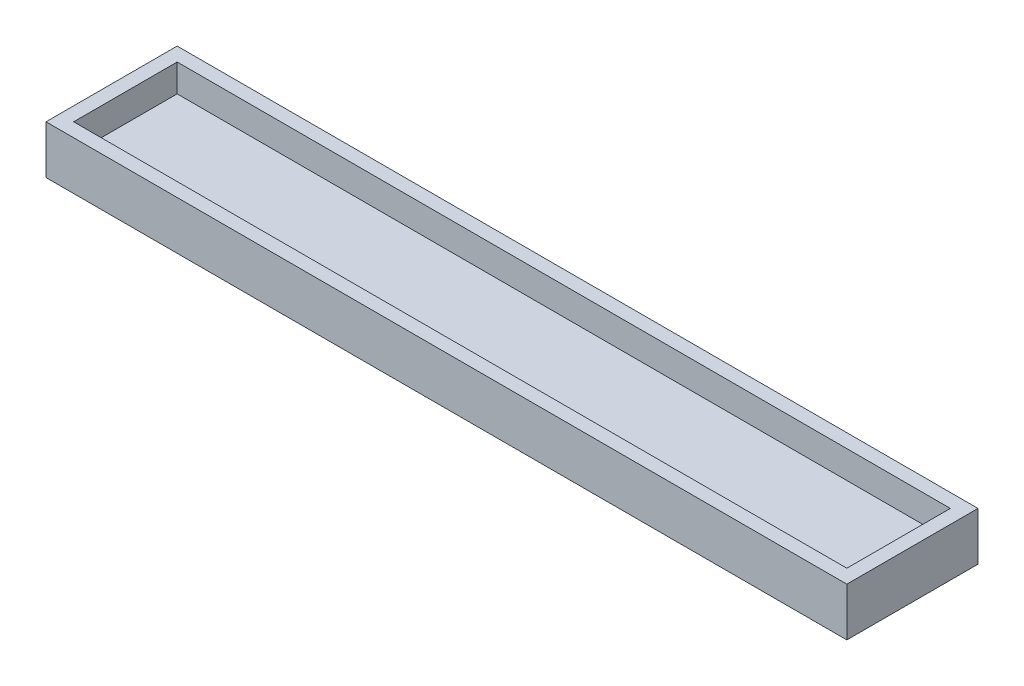
ISO-10303-21;
HEADER;
FILE_DESCRIPTION(('STEP AP214'),'2;1');
FILE_NAME('part.step','',(''),(''),'','','');
FILE_SCHEMA(('AUTOMOTIVE_DESIGN { 1 0 10303 214 1 1 1 1 }'));
ENDSEC;
DATA;
#1=APPLICATION_CONTEXT('core data for automotive mechanical design processes');
#2=APPLICATION_PROTOCOL_DEFINITION('international standard','automotive_design',2000,#1);
#3=PRODUCT_CONTEXT('',#1,'mechanical');
#4=PRODUCT('Part','Part','',(#3));
#5=PRODUCT_RELATED_PRODUCT_CATEGORY('part','',(#4));
#6=PRODUCT_DEFINITION_FORMATION('','',#4);
#7=PRODUCT_DEFINITION_CONTEXT('part definition',#1,'design');
#8=PRODUCT_DEFINITION('design','',#6,#7);
#9=PRODUCT_DEFINITION_SHAPE('','',#8);
#10=(LENGTH_UNIT() NAMED_UNIT(*) SI_UNIT(.MILLI.,.METRE.));
#11=(NAMED_UNIT(*) PLANE_ANGLE_UNIT() SI_UNIT($,.RADIAN.));
#12=(NAMED_UNIT(*) SI_UNIT($,.STERADIAN.) SOLID_ANGLE_UNIT());
#13=UNCERTAINTY_MEASURE_WITH_UNIT(LENGTH_MEASURE(1.E-05),#10,'distance_accuracy_value','');
#14=(GEOMETRIC_REPRESENTATION_CONTEXT(3) GLOBAL_UNCERTAINTY_ASSIGNED_CONTEXT((#13)) GLOBAL_UNIT_ASSIGNED_CONTEXT((#10,
#11,#12)) REPRESENTATION_CONTEXT('',''));
#15=CARTESIAN_POINT('',(0.,0.,0.));
#16=DIRECTION('',(0.,0.,1.));
#17=DIRECTION('',(1.,0.,0.));
#18=AXIS2_PLACEMENT_3D('',#15,#16,#17);
#19=CARTESIAN_POINT('',(0.,3.,0.));
#20=DIRECTION('',(0.,-1.,0.));
#21=DIRECTION('',(0.,0.,-1.));
#22=AXIS2_PLACEMENT_3D('',#19,#20,#21);
#23=PLANE('',#22);
#24=DIRECTION('',(1.,0.,0.));
#25=VECTOR('',#24,1.);
#26=CARTESIAN_POINT('',(0.,3.,15.));
#27=LINE('',#26,#25);
#28=CARTESIAN_POINT('',(0.,3.,15.));
#29=VERTEX_POINT('',#28);
#30=CARTESIAN_POINT('',(112.,3.,15.));
#31=VERTEX_POINT('',#30);
#32=EDGE_CURVE('E185',#29,#31,#27,.T.);
#33=ORIENTED_EDGE('',*,*,#32,.T.);
#34=DIRECTION('',(0.,0.,1.));
#35=VECTOR('',#34,1.);
#36=CARTESIAN_POINT('',(112.,3.,0.));
#37=LINE('',#36,#35);
#38=CARTESIAN_POINT('',(112.,3.,0.));
#39=VERTEX_POINT('',#38);
#40=EDGE_CURVE('E187',#39,#31,#37,.T.);
#41=ORIENTED_EDGE('',*,*,#40,.F.);
#42=DIRECTION('',(1.,0.,0.));
#43=VECTOR('',#42,1.);
#44=CARTESIAN_POINT('',(0.,3.,0.));
#45=LINE('',#44,#43);
#46=CARTESIAN_POINT('',(0.,3.,0.));
#47=VERTEX_POINT('',#46);
#48=EDGE_CURVE('E67',#47,#39,#45,.T.);
#49=ORIENTED_EDGE('',*,*,#48,.F.);
#50=DIRECTION('',(0.,0.,1.));
#51=VECTOR('',#50,1.);
#52=CARTESIAN_POINT('',(0.,3.,0.));
#53=LINE('',#52,#51);
#54=EDGE_CURVE('E12',#47,#29,#53,.T.);
#55=ORIENTED_EDGE('',*,*,#54,.T.);
#56=EDGE_LOOP('',(#33,#41,#49,#55));
#57=FACE_BOUND('',#56,.T.);
#58=ADVANCED_FACE('F59',(#57),#23,.F.);
#59=CARTESIAN_POINT('',(0.,7.,0.));
#60=DIRECTION('',(0.,0.,-1.));
#61=DIRECTION('',(-1.,0.,0.));
#62=AXIS2_PLACEMENT_3D('',#59,#60,#61);
#63=PLANE('',#62);
#64=DIRECTION('',(0.,-1.,0.));
#65=VECTOR('',#64,1.);
#66=CARTESIAN_POINT('',(0.,7.,0.));
#67=LINE('',#66,#65);
#68=CARTESIAN_POINT('',(0.,7.,0.));
#69=VERTEX_POINT('',#68);
#70=EDGE_CURVE('E147',#69,#47,#67,.T.);
#71=ORIENTED_EDGE('',*,*,#70,.T.);
#72=ORIENTED_EDGE('',*,*,#48,.T.);
#73=DIRECTION('',(0.,-1.,0.));
#74=VECTOR('',#73,1.);
#75=CARTESIAN_POINT('',(112.,7.,0.));
#76=LINE('',#75,#74);
#77=CARTESIAN_POINT('',(112.,7.,0.));
#78=VERTEX_POINT('',#77);
#79=EDGE_CURVE('E123',#78,#39,#76,.T.);
#80=ORIENTED_EDGE('',*,*,#79,.F.);
#81=DIRECTION('',(1.,0.,0.));
#82=VECTOR('',#81,1.);
#83=CARTESIAN_POINT('',(0.,7.,0.));
#84=LINE('',#83,#82);
#85=EDGE_CURVE('E131',#69,#78,#84,.T.);
#86=ORIENTED_EDGE('',*,*,#85,.F.);
#87=EDGE_LOOP('',(#71,#72,#80,#86));
#88=FACE_BOUND('',#87,.T.);
#89=ADVANCED_FACE('F136',(#88),#63,.F.);
#90=CARTESIAN_POINT('',(0.,7.,15.));
#91=DIRECTION('',(-1.,0.,0.));
#92=DIRECTION('',(0.,0.,1.));
#93=AXIS2_PLACEMENT_3D('',#90,#91,#92);
#94=PLANE('',#93);
#95=DIRECTION('',(0.,-1.,0.));
#96=VECTOR('',#95,1.);
#97=CARTESIAN_POINT('',(0.,7.,15.));
#98=LINE('',#97,#96);
#99=CARTESIAN_POINT('',(0.,7.,15.));
#100=VERTEX_POINT('',#99);
#101=EDGE_CURVE('E150',#100,#29,#98,.T.);
#102=ORIENTED_EDGE('',*,*,#101,.T.);
#103=ORIENTED_EDGE('',*,*,#54,.F.);
#104=ORIENTED_EDGE('',*,*,#70,.F.);
#105=DIRECTION('',(0.,0.,-1.));
#106=VECTOR('',#105,1.);
#107=CARTESIAN_POINT('',(0.,7.,15.));
#108=LINE('',#107,#106);
#109=EDGE_CURVE('E138',#100,#69,#108,.T.);
#110=ORIENTED_EDGE('',*,*,#109,.F.);
#111=EDGE_LOOP('',(#102,#103,#104,#110));
#112=FACE_BOUND('',#111,.T.);
#113=ADVANCED_FACE('F191',(#112),#94,.F.);
#114=CARTESIAN_POINT('',(0.,7.,15.));
#115=DIRECTION('',(0.,0.,-1.));
#116=DIRECTION('',(-1.,0.,0.));
#117=AXIS2_PLACEMENT_3D('',#114,#115,#116);
#118=PLANE('',#117);
#119=ORIENTED_EDGE('',*,*,#32,.F.);
#120=ORIENTED_EDGE('',*,*,#101,.F.);
#121=DIRECTION('',(1.,0.,0.));
#122=VECTOR('',#121,1.);
#123=CARTESIAN_POINT('',(0.,7.,15.));
#124=LINE('',#123,#122);
#125=CARTESIAN_POINT('',(112.,7.,15.));
#126=VERTEX_POINT('',#125);
#127=EDGE_CURVE('E130',#100,#126,#124,.T.);
#128=ORIENTED_EDGE('',*,*,#127,.T.);
#129=DIRECTION('',(0.,-1.,0.));
#130=VECTOR('',#129,1.);
#131=CARTESIAN_POINT('',(112.,7.,15.));
#132=LINE('',#131,#130);
#133=EDGE_CURVE('E125',#126,#31,#132,.T.);
#134=ORIENTED_EDGE('',*,*,#133,.T.);
#135=EDGE_LOOP('',(#119,#120,#128,#134));
#136=FACE_BOUND('',#135,.T.);
#137=ADVANCED_FACE('F189',(#136),#118,.T.);
#138=CARTESIAN_POINT('',(112.,7.,15.));
#139=DIRECTION('',(-1.,0.,0.));
#140=DIRECTION('',(0.,0.,1.));
#141=AXIS2_PLACEMENT_3D('',#138,#139,#140);
#142=PLANE('',#141);
#143=ORIENTED_EDGE('',*,*,#40,.T.);
#144=ORIENTED_EDGE('',*,*,#133,.F.);
#145=DIRECTION('',(0.,0.,-1.));
#146=VECTOR('',#145,1.);
#147=CARTESIAN_POINT('',(112.,7.,15.));
#148=LINE('',#147,#146);
#149=EDGE_CURVE('E119',#126,#78,#148,.T.);
#150=ORIENTED_EDGE('',*,*,#149,.T.);
#151=ORIENTED_EDGE('',*,*,#79,.T.);
#152=EDGE_LOOP('',(#143,#144,#150,#151));
#153=FACE_BOUND('',#152,.T.);
#154=ADVANCED_FACE('F122',(#153),#142,.T.);
#155=CARTESIAN_POINT('',(-2.,7.,17.));
#156=DIRECTION('',(0.,0.,-1.));
#157=DIRECTION('',(-1.,0.,0.));
#158=AXIS2_PLACEMENT_3D('',#155,#156,#157);
#159=PLANE('',#158);
#160=DIRECTION('',(1.,0.,0.));
#161=VECTOR('',#160,1.);
#162=CARTESIAN_POINT('',(-2.,0.,17.));
#163=LINE('',#162,#161);
#164=CARTESIAN_POINT('',(-2.,0.,17.));
#165=VERTEX_POINT('',#164);
#166=CARTESIAN_POINT('',(114.,0.,17.));
#167=VERTEX_POINT('',#166);
#168=EDGE_CURVE('E149',#165,#167,#163,.T.);
#169=ORIENTED_EDGE('',*,*,#168,.T.);
#170=DIRECTION('',(0.,-1.,0.));
#171=VECTOR('',#170,1.);
#172=CARTESIAN_POINT('',(114.,7.,17.));
#173=LINE('',#172,#171);
#174=CARTESIAN_POINT('',(114.,7.,17.));
#175=VERTEX_POINT('',#174);
#176=EDGE_CURVE('E182',#175,#167,#173,.T.);
#177=ORIENTED_EDGE('',*,*,#176,.F.);
#178=DIRECTION('',(1.,0.,0.));
#179=VECTOR('',#178,1.);
#180=CARTESIAN_POINT('',(-2.,7.,17.));
#181=LINE('',#180,#179);
#182=CARTESIAN_POINT('',(-2.,7.,17.));
#183=VERTEX_POINT('',#182);
#184=EDGE_CURVE('E154',#183,#175,#181,.T.);
#185=ORIENTED_EDGE('',*,*,#184,.F.);
#186=DIRECTION('',(0.,-1.,0.));
#187=VECTOR('',#186,1.);
#188=CARTESIAN_POINT('',(-2.,7.,17.));
#189=LINE('',#188,#187);
#190=EDGE_CURVE('E166',#183,#165,#189,.T.);
#191=ORIENTED_EDGE('',*,*,#190,.T.);
#192=EDGE_LOOP('',(#169,#177,#185,#191));
#193=FACE_BOUND('',#192,.T.);
#194=ADVANCED_FACE('F204',(#193),#159,.F.);
#195=CARTESIAN_POINT('',(114.,7.,17.));
#196=DIRECTION('',(-1.,0.,0.));
#197=DIRECTION('',(0.,0.,1.));
#198=AXIS2_PLACEMENT_3D('',#195,#196,#197);
#199=PLANE('',#198);
#200=DIRECTION('',(0.,0.,-1.));
#201=VECTOR('',#200,1.);
#202=CARTESIAN_POINT('',(114.,0.,17.));
#203=LINE('',#202,#201);
#204=CARTESIAN_POINT('',(114.,0.,-2.));
#205=VERTEX_POINT('',#204);
#206=EDGE_CURVE('E169',#167,#205,#203,.T.);
#207=ORIENTED_EDGE('',*,*,#206,.T.);
#208=DIRECTION('',(0.,-1.,0.));
#209=VECTOR('',#208,1.);
#210=CARTESIAN_POINT('',(114.,7.,-2.));
#211=LINE('',#210,#209);
#212=CARTESIAN_POINT('',(114.,7.,-2.));
#213=VERTEX_POINT('',#212);
#214=EDGE_CURVE('E180',#213,#205,#211,.T.);
#215=ORIENTED_EDGE('',*,*,#214,.F.);
#216=DIRECTION('',(0.,0.,-1.));
#217=VECTOR('',#216,1.);
#218=CARTESIAN_POINT('',(114.,7.,17.));
#219=LINE('',#218,#217);
#220=EDGE_CURVE('E157',#175,#213,#219,.T.);
#221=ORIENTED_EDGE('',*,*,#220,.F.);
#222=ORIENTED_EDGE('',*,*,#176,.T.);
#223=EDGE_LOOP('',(#207,#215,#221,#222));
#224=FACE_BOUND('',#223,.T.);
#225=ADVANCED_FACE('F207',(#224),#199,.F.);
#226=CARTESIAN_POINT('',(-2.,7.,-2.));
#227=DIRECTION('',(0.,0.,-1.));
#228=DIRECTION('',(-1.,0.,0.));
#229=AXIS2_PLACEMENT_3D('',#226,#227,#228);
#230=PLANE('',#229);
#231=DIRECTION('',(1.,0.,0.));
#232=VECTOR('',#231,1.);
#233=CARTESIAN_POINT('',(-2.,0.,-2.));
#234=LINE('',#233,#232);
#235=CARTESIAN_POINT('',(-2.,0.,-2.));
#236=VERTEX_POINT('',#235);
#237=EDGE_CURVE('E172',#236,#205,#234,.T.);
#238=ORIENTED_EDGE('',*,*,#237,.F.);
#239=DIRECTION('',(0.,-1.,0.));
#240=VECTOR('',#239,1.);
#241=CARTESIAN_POINT('',(-2.,7.,-2.));
#242=LINE('',#241,#240);
#243=CARTESIAN_POINT('',(-2.,7.,-2.));
#244=VERTEX_POINT('',#243);
#245=EDGE_CURVE('E178',#244,#236,#242,.T.);
#246=ORIENTED_EDGE('',*,*,#245,.F.);
#247=DIRECTION('',(1.,0.,0.));
#248=VECTOR('',#247,1.);
#249=CARTESIAN_POINT('',(-2.,7.,-2.));
#250=LINE('',#249,#248);
#251=EDGE_CURVE('E160',#244,#213,#250,.T.);
#252=ORIENTED_EDGE('',*,*,#251,.T.);
#253=ORIENTED_EDGE('',*,*,#214,.T.);
#254=EDGE_LOOP('',(#238,#246,#252,#253));
#255=FACE_BOUND('',#254,.T.);
#256=ADVANCED_FACE('F211',(#255),#230,.T.);
#257=CARTESIAN_POINT('',(-2.,7.,17.));
#258=DIRECTION('',(-1.,0.,0.));
#259=DIRECTION('',(0.,0.,1.));
#260=AXIS2_PLACEMENT_3D('',#257,#258,#259);
#261=PLANE('',#260);
#262=DIRECTION('',(0.,0.,-1.));
#263=VECTOR('',#262,1.);
#264=CARTESIAN_POINT('',(-2.,0.,17.));
#265=LINE('',#264,#263);
#266=EDGE_CURVE('E158',#165,#236,#265,.T.);
#267=ORIENTED_EDGE('',*,*,#266,.F.);
#268=ORIENTED_EDGE('',*,*,#190,.F.);
#269=DIRECTION('',(0.,0.,-1.));
#270=VECTOR('',#269,1.);
#271=CARTESIAN_POINT('',(-2.,7.,17.));
#272=LINE('',#271,#270);
#273=EDGE_CURVE('E163',#183,#244,#272,.T.);
#274=ORIENTED_EDGE('',*,*,#273,.T.);
#275=ORIENTED_EDGE('',*,*,#245,.T.);
#276=EDGE_LOOP('',(#267,#268,#274,#275));
#277=FACE_BOUND('',#276,.T.);
#278=ADVANCED_FACE('F215',(#277),#261,.T.);
#279=CARTESIAN_POINT('',(0.,7.,0.));
#280=DIRECTION('',(0.,1.,0.));
#281=DIRECTION('',(0.,0.,1.));
#282=AXIS2_PLACEMENT_3D('',#279,#280,#281);
#283=PLANE('',#282);
#284=ORIENTED_EDGE('',*,*,#85,.T.);
#285=ORIENTED_EDGE('',*,*,#149,.F.);
#286=ORIENTED_EDGE('',*,*,#127,.F.);
#287=ORIENTED_EDGE('',*,*,#109,.T.);
#288=EDGE_LOOP('',(#284,#285,#286,#287));
#289=FACE_BOUND('',#288,.T.);
#290=ORIENTED_EDGE('',*,*,#184,.T.);
#291=ORIENTED_EDGE('',*,*,#220,.T.);
#292=ORIENTED_EDGE('',*,*,#251,.F.);
#293=ORIENTED_EDGE('',*,*,#273,.F.);
#294=EDGE_LOOP('',(#290,#291,#292,#293));
#295=FACE_BOUND('',#294,.T.);
#296=ADVANCED_FACE('F140',(#289,#295),#283,.T.);
#297=CARTESIAN_POINT('',(0.,0.,0.));
#298=DIRECTION('',(0.,-1.,0.));
#299=DIRECTION('',(0.,0.,-1.));
#300=AXIS2_PLACEMENT_3D('',#297,#298,#299);
#301=PLANE('',#300);
#302=ORIENTED_EDGE('',*,*,#168,.F.);
#303=ORIENTED_EDGE('',*,*,#266,.T.);
#304=ORIENTED_EDGE('',*,*,#237,.T.);
#305=ORIENTED_EDGE('',*,*,#206,.F.);
#306=EDGE_LOOP('',(#302,#303,#304,#305));
#307=FACE_BOUND('',#306,.T.);
#308=ADVANCED_FACE('F61',(#307),#301,.T.);
#309=CLOSED_SHELL('',(#58,#89,#113,#137,#154,#194,#225,#256,#278,#296,#308));
#310=MANIFOLD_SOLID_BREP('B2',#309);
#311=ADVANCED_BREP_SHAPE_REPRESENTATION('',(#18,#310),#14);
#312=SHAPE_DEFINITION_REPRESENTATION(#9,#311);
ENDSEC;
END-ISO-10303-21;
